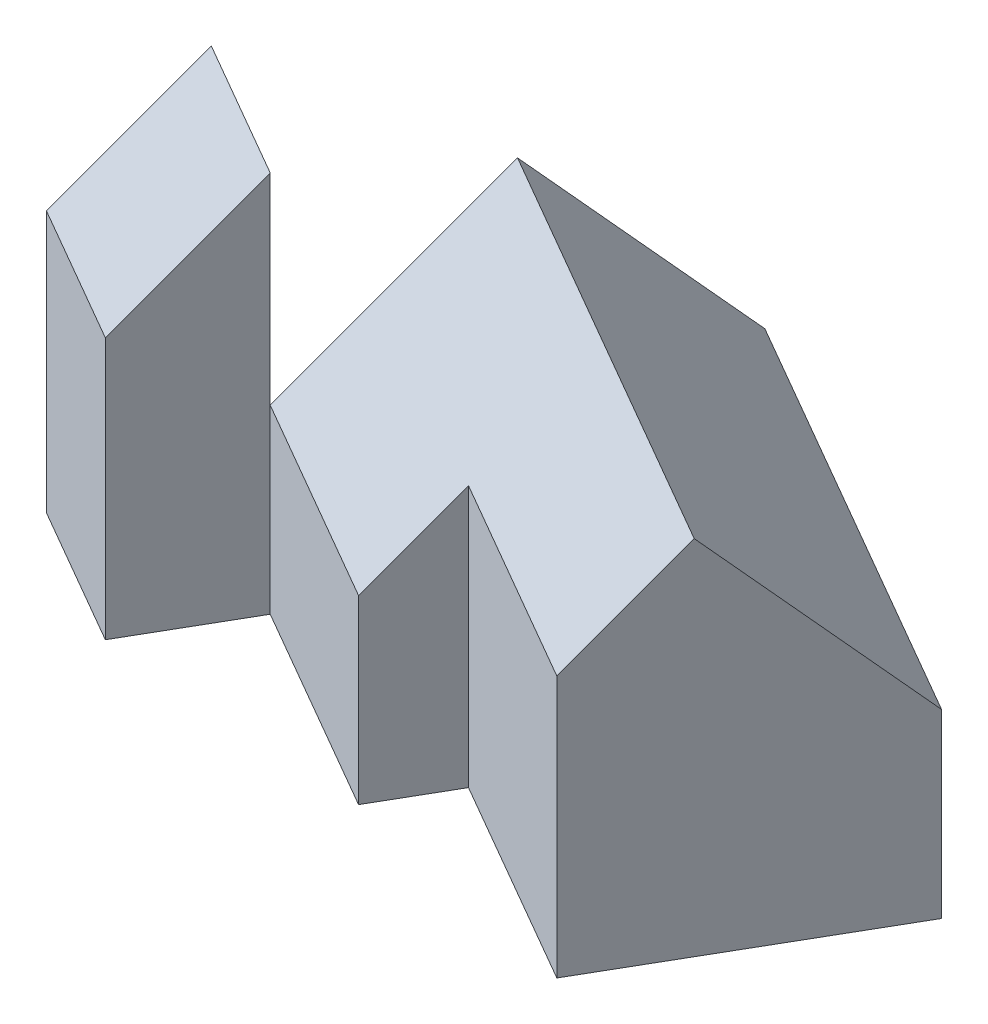
ISO-10303-21;
HEADER;
FILE_DESCRIPTION(('STEP AP214'),'2;1');
FILE_NAME('part.step','',(''),(''),'','','');
FILE_SCHEMA(('AUTOMOTIVE_DESIGN { 1 0 10303 214 1 1 1 1 }'));
ENDSEC;
DATA;
#1=APPLICATION_CONTEXT('core data for automotive mechanical design processes');
#2=APPLICATION_PROTOCOL_DEFINITION('international standard','automotive_design',2000,#1);
#3=PRODUCT_CONTEXT('',#1,'mechanical');
#4=PRODUCT('Part','Part','',(#3));
#5=PRODUCT_RELATED_PRODUCT_CATEGORY('part','',(#4));
#6=PRODUCT_DEFINITION_FORMATION('','',#4);
#7=PRODUCT_DEFINITION_CONTEXT('part definition',#1,'design');
#8=PRODUCT_DEFINITION('design','',#6,#7);
#9=PRODUCT_DEFINITION_SHAPE('','',#8);
#10=(LENGTH_UNIT() NAMED_UNIT(*) SI_UNIT(.MILLI.,.METRE.));
#11=(NAMED_UNIT(*) PLANE_ANGLE_UNIT() SI_UNIT($,.RADIAN.));
#12=(NAMED_UNIT(*) SI_UNIT($,.STERADIAN.) SOLID_ANGLE_UNIT());
#13=UNCERTAINTY_MEASURE_WITH_UNIT(LENGTH_MEASURE(1.E-05),#10,'distance_accuracy_value','');
#14=(GEOMETRIC_REPRESENTATION_CONTEXT(3) GLOBAL_UNCERTAINTY_ASSIGNED_CONTEXT((#13)) GLOBAL_UNIT_ASSIGNED_CONTEXT((#10,
#11,#12)) REPRESENTATION_CONTEXT('',''));
#15=CARTESIAN_POINT('',(0.,0.,0.));
#16=DIRECTION('',(0.,0.,1.));
#17=DIRECTION('',(1.,0.,0.));
#18=AXIS2_PLACEMENT_3D('',#15,#16,#17);
#19=CARTESIAN_POINT('',(-84.1610832087339,95.,25.7712721375595));
#20=DIRECTION('',(-0.86602540378444,0.,-0.499999999999997));
#21=DIRECTION('',(-0.499999999999997,0.,0.86602540378444));
#22=AXIS2_PLACEMENT_3D('',#19,#20,#21);
#23=PLANE('',#22);
#24=DIRECTION('',(0.,-1.,0.));
#25=VECTOR('',#24,1.);
#26=CARTESIAN_POINT('',(-51.9615242270664,95.,-29.9999999999998));
#27=LINE('',#26,#25);
#28=CARTESIAN_POINT('',(-51.9615242270664,64.9999999999999,-29.9999999999998));
#29=VERTEX_POINT('',#28);
#30=CARTESIAN_POINT('',(-51.9615242270664,0.,-29.9999999999998));
#31=VERTEX_POINT('',#30);
#32=EDGE_CURVE('E79',#29,#31,#27,.T.);
#33=ORIENTED_EDGE('',*,*,#32,.F.);
#34=DIRECTION('',(-0.353553390593272,-0.707106781186547,0.612372435695796));
#35=VECTOR('',#34,1.);
#36=CARTESIAN_POINT('',(-60.5613037179002,47.8004410183323,-15.1047449879867));
#37=LINE('',#36,#35);
#38=CARTESIAN_POINT('',(-61.9615242270663,45.,-12.679491924311));
#39=VERTEX_POINT('',#38);
#40=EDGE_CURVE('E158',#29,#39,#37,.T.);
#41=ORIENTED_EDGE('',*,*,#40,.T.);
#42=DIRECTION('',(0.,-1.,0.));
#43=VECTOR('',#42,1.);
#44=CARTESIAN_POINT('',(-61.9615242270664,95.,-12.679491924311));
#45=LINE('',#44,#43);
#46=CARTESIAN_POINT('',(-61.9615242270664,0.,-12.679491924311));
#47=VERTEX_POINT('',#46);
#48=EDGE_CURVE('E94',#39,#47,#45,.T.);
#49=ORIENTED_EDGE('',*,*,#48,.T.);
#50=DIRECTION('',(0.499999999999997,0.,-0.86602540378444));
#51=VECTOR('',#50,1.);
#52=CARTESIAN_POINT('',(-84.1610832087339,0.,25.7712721375595));
#53=LINE('',#52,#51);
#54=EDGE_CURVE('E160',#47,#31,#53,.T.);
#55=ORIENTED_EDGE('',*,*,#54,.T.);
#56=EDGE_LOOP('',(#33,#41,#49,#55));
#57=FACE_BOUND('',#56,.T.);
#58=ADVANCED_FACE('F72',(#57),#23,.F.);
#59=CARTESIAN_POINT('',(-212.033597537442,95.,-122.417654615486));
#60=DIRECTION('',(0.499999999999997,0.,-0.86602540378444));
#61=DIRECTION('',(-0.86602540378444,0.,-0.499999999999997));
#62=AXIS2_PLACEMENT_3D('',#59,#60,#61);
#63=PLANE('',#62);
#64=DIRECTION('',(0.,-1.,0.));
#65=VECTOR('',#64,1.);
#66=CARTESIAN_POINT('',(0.,95.,0.));
#67=LINE('',#66,#65);
#68=CARTESIAN_POINT('',(0.,65.,0.));
#69=VERTEX_POINT('',#68);
#70=CARTESIAN_POINT('',(0.,0.,0.));
#71=VERTEX_POINT('',#70);
#72=EDGE_CURVE('E181',#69,#71,#67,.T.);
#73=ORIENTED_EDGE('',*,*,#72,.F.);
#74=DIRECTION('',(-0.86602540378444,0.,-0.499999999999997));
#75=VECTOR('',#74,1.);
#76=CARTESIAN_POINT('',(-212.033597537442,64.9999999999998,-122.417654615486));
#77=LINE('',#76,#75);
#78=EDGE_CURVE('E144',#69,#29,#77,.T.);
#79=ORIENTED_EDGE('',*,*,#78,.T.);
#80=ORIENTED_EDGE('',*,*,#32,.T.);
#81=DIRECTION('',(0.86602540378444,0.,0.499999999999997));
#82=VECTOR('',#81,1.);
#83=CARTESIAN_POINT('',(-212.033597537442,0.,-122.417654615486));
#84=LINE('',#83,#82);
#85=EDGE_CURVE('E162',#31,#71,#84,.T.);
#86=ORIENTED_EDGE('',*,*,#85,.T.);
#87=EDGE_LOOP('',(#73,#79,#80,#86));
#88=FACE_BOUND('',#87,.T.);
#89=ADVANCED_FACE('F185',(#88),#63,.F.);
#90=CARTESIAN_POINT('',(-32.1995589816676,95.,55.7712721375595));
#91=DIRECTION('',(-0.86602540378444,0.,-0.499999999999998));
#92=DIRECTION('',(-0.499999999999998,0.,0.86602540378444));
#93=AXIS2_PLACEMENT_3D('',#90,#91,#92);
#94=PLANE('',#93);
#95=DIRECTION('',(0.,-1.,0.));
#96=VECTOR('',#95,1.);
#97=CARTESIAN_POINT('',(34.9999999999999,95.,-60.6217782649108));
#98=LINE('',#97,#96);
#99=CARTESIAN_POINT('',(34.9999999999999,45.,-60.6217782649108));
#100=VERTEX_POINT('',#99);
#101=CARTESIAN_POINT('',(34.9999999999999,0.,-60.6217782649108));
#102=VERTEX_POINT('',#101);
#103=EDGE_CURVE('E151',#100,#102,#98,.T.);
#104=ORIENTED_EDGE('',*,*,#103,.F.);
#105=DIRECTION('',(0.353553390593272,-0.707106781186548,-0.612372435695796));
#106=VECTOR('',#105,1.);
#107=CARTESIAN_POINT('',(12.5,90.,-21.650635094611));
#108=LINE('',#107,#106);
#109=CARTESIAN_POINT('',(12.5,90.,-21.650635094611));
#110=VERTEX_POINT('',#109);
#111=EDGE_CURVE('E135',#110,#100,#108,.T.);
#112=ORIENTED_EDGE('',*,*,#111,.F.);
#113=DIRECTION('',(0.353553390593272,0.707106781186547,-0.612372435695796));
#114=VECTOR('',#113,1.);
#115=CARTESIAN_POINT('',(-9.99999999999997,45.,17.3205080756888));
#116=LINE('',#115,#114);
#117=EDGE_CURVE('E141',#69,#110,#116,.T.);
#118=ORIENTED_EDGE('',*,*,#117,.F.);
#119=ORIENTED_EDGE('',*,*,#72,.T.);
#120=DIRECTION('',(0.499999999999998,0.,-0.86602540378444));
#121=VECTOR('',#120,1.);
#122=CARTESIAN_POINT('',(-32.1995589816676,0.,55.7712721375595));
#123=LINE('',#122,#121);
#124=EDGE_CURVE('E165',#71,#102,#123,.T.);
#125=ORIENTED_EDGE('',*,*,#124,.T.);
#126=EDGE_LOOP('',(#104,#112,#118,#119,#125));
#127=FACE_BOUND('',#126,.T.);
#128=ADVANCED_FACE('F149',(#127),#94,.F.);
#129=CARTESIAN_POINT('',(-177.033597537442,95.,-183.039432880397));
#130=DIRECTION('',(-0.5,0.,0.866025403784439));
#131=DIRECTION('',(0.866025403784439,0.,0.5));
#132=AXIS2_PLACEMENT_3D('',#129,#130,#131);
#133=PLANE('',#132);
#134=DIRECTION('',(0.,-1.,0.));
#135=VECTOR('',#134,1.);
#136=CARTESIAN_POINT('',(-68.9230484541331,95.,-120.621778264911));
#137=LINE('',#136,#135);
#138=CARTESIAN_POINT('',(-68.9230484541332,45.,-120.621778264911));
#139=VERTEX_POINT('',#138);
#140=CARTESIAN_POINT('',(-68.9230484541331,0.,-120.621778264911));
#141=VERTEX_POINT('',#140);
#142=EDGE_CURVE('E178',#139,#141,#137,.T.);
#143=ORIENTED_EDGE('',*,*,#142,.F.);
#144=DIRECTION('',(0.86602540378444,0.,0.499999999999998));
#145=VECTOR('',#144,1.);
#146=CARTESIAN_POINT('',(-73.2531754730551,45.,-123.121778264911));
#147=LINE('',#146,#145);
#148=EDGE_CURVE('E137',#139,#100,#147,.T.);
#149=ORIENTED_EDGE('',*,*,#148,.T.);
#150=ORIENTED_EDGE('',*,*,#103,.T.);
#151=DIRECTION('',(-0.866025403784439,0.,-0.5));
#152=VECTOR('',#151,1.);
#153=CARTESIAN_POINT('',(-177.033597537442,0.,-183.039432880397));
#154=LINE('',#153,#152);
#155=EDGE_CURVE('E167',#102,#141,#154,.T.);
#156=ORIENTED_EDGE('',*,*,#155,.T.);
#157=EDGE_LOOP('',(#143,#149,#150,#156));
#158=FACE_BOUND('',#157,.T.);
#159=ADVANCED_FACE('F199',(#158),#133,.F.);
#160=CARTESIAN_POINT('',(-136.1226074358,95.,-4.22872786244057));
#161=DIRECTION('',(0.866025403784442,0.,0.499999999999994));
#162=DIRECTION('',(0.499999999999994,0.,-0.866025403784442));
#163=AXIS2_PLACEMENT_3D('',#160,#161,#162);
#164=PLANE('',#163);
#165=DIRECTION('',(0.35355339059327,0.707106781186547,-0.612372435695797));
#166=VECTOR('',#165,1.);
#167=CARTESIAN_POINT('',(-112.522827944967,47.8004410183324,-45.1047449879868));
#168=LINE('',#167,#166);
#169=CARTESIAN_POINT('',(-113.923048454133,45.,-42.6794919243109));
#170=VERTEX_POINT('',#169);
#171=CARTESIAN_POINT('',(-91.423048454133,90.,-81.6506350946108));
#172=VERTEX_POINT('',#171);
#173=EDGE_CURVE('E86',#170,#172,#168,.T.);
#174=ORIENTED_EDGE('',*,*,#173,.T.);
#175=DIRECTION('',(0.35355339059327,-0.707106781186548,-0.612372435695797));
#176=VECTOR('',#175,1.);
#177=CARTESIAN_POINT('',(-115.022827944967,137.199558981668,-40.7746179690646));
#178=LINE('',#177,#176);
#179=EDGE_CURVE('E13',#172,#139,#178,.T.);
#180=ORIENTED_EDGE('',*,*,#179,.T.);
#181=ORIENTED_EDGE('',*,*,#142,.T.);
#182=DIRECTION('',(-0.499999999999994,0.,0.866025403784442));
#183=VECTOR('',#182,1.);
#184=CARTESIAN_POINT('',(-136.1226074358,0.,-4.22872786244057));
#185=LINE('',#184,#183);
#186=CARTESIAN_POINT('',(-113.923048454133,0.,-42.6794919243109));
#187=VERTEX_POINT('',#186);
#188=EDGE_CURVE('E170',#141,#187,#185,.T.);
#189=ORIENTED_EDGE('',*,*,#188,.T.);
#190=DIRECTION('',(0.,-1.,0.));
#191=VECTOR('',#190,1.);
#192=CARTESIAN_POINT('',(-113.923048454133,95.,-42.6794919243109));
#193=LINE('',#192,#191);
#194=EDGE_CURVE('E176',#170,#187,#193,.T.);
#195=ORIENTED_EDGE('',*,*,#194,.F.);
#196=EDGE_LOOP('',(#174,#180,#181,#189,#195));
#197=FACE_BOUND('',#196,.T.);
#198=ADVANCED_FACE('F204',(#197),#164,.F.);
#199=CARTESIAN_POINT('',(-222.033597537442,95.,-105.097146539797));
#200=DIRECTION('',(0.499999999999997,0.,-0.86602540378444));
#201=DIRECTION('',(-0.86602540378444,0.,-0.499999999999997));
#202=AXIS2_PLACEMENT_3D('',#199,#200,#201);
#203=PLANE('',#202);
#204=ORIENTED_EDGE('',*,*,#48,.F.);
#205=DIRECTION('',(0.86602540378444,0.,0.499999999999998));
#206=VECTOR('',#205,1.);
#207=CARTESIAN_POINT('',(-118.253175473055,45.,-45.1794919243109));
#208=LINE('',#207,#206);
#209=EDGE_CURVE('E138',#170,#39,#208,.T.);
#210=ORIENTED_EDGE('',*,*,#209,.F.);
#211=ORIENTED_EDGE('',*,*,#194,.T.);
#212=DIRECTION('',(0.86602540378444,0.,0.499999999999997));
#213=VECTOR('',#212,1.);
#214=CARTESIAN_POINT('',(-222.033597537442,0.,-105.097146539797));
#215=LINE('',#214,#213);
#216=EDGE_CURVE('E173',#187,#47,#215,.T.);
#217=ORIENTED_EDGE('',*,*,#216,.T.);
#218=EDGE_LOOP('',(#204,#210,#211,#217));
#219=FACE_BOUND('',#218,.T.);
#220=ADVANCED_FACE('F208',(#219),#203,.F.);
#221=CARTESIAN_POINT('',(-244.23315651911,0.,-66.6463824779267));
#222=DIRECTION('',(0.,1.,0.));
#223=DIRECTION('',(0.,0.,1.));
#224=AXIS2_PLACEMENT_3D('',#221,#222,#223);
#225=PLANE('',#224);
#226=ORIENTED_EDGE('',*,*,#54,.F.);
#227=ORIENTED_EDGE('',*,*,#216,.F.);
#228=ORIENTED_EDGE('',*,*,#188,.F.);
#229=ORIENTED_EDGE('',*,*,#155,.F.);
#230=ORIENTED_EDGE('',*,*,#124,.F.);
#231=ORIENTED_EDGE('',*,*,#85,.F.);
#232=EDGE_LOOP('',(#226,#227,#228,#229,#230,#231));
#233=FACE_BOUND('',#232,.T.);
#234=ADVANCED_FACE('F189',(#233),#225,.F.);
#235=CARTESIAN_POINT('',(-95.753175473055,90.,-84.1506350946107));
#236=DIRECTION('',(-0.353553390593272,-0.707106781186548,0.612372435695795));
#237=DIRECTION('',(0.,-0.654653670707978,-0.755928946018454));
#238=AXIS2_PLACEMENT_3D('',#235,#236,#237);
#239=PLANE('',#238);
#240=DIRECTION('',(0.86602540378444,0.,0.499999999999998));
#241=VECTOR('',#240,1.);
#242=CARTESIAN_POINT('',(-95.753175473055,90.,-84.1506350946107));
#243=LINE('',#242,#241);
#244=EDGE_CURVE('E131',#172,#110,#243,.T.);
#245=ORIENTED_EDGE('',*,*,#244,.T.);
#246=ORIENTED_EDGE('',*,*,#111,.T.);
#247=ORIENTED_EDGE('',*,*,#148,.F.);
#248=ORIENTED_EDGE('',*,*,#179,.F.);
#249=EDGE_LOOP('',(#245,#246,#247,#248));
#250=FACE_BOUND('',#249,.T.);
#251=ADVANCED_FACE('F133',(#250),#239,.F.);
#252=CARTESIAN_POINT('',(-118.253175473055,45.,-45.1794919243109));
#253=DIRECTION('',(0.353553390593272,-0.707106781186548,-0.612372435695795));
#254=DIRECTION('',(0.,0.654653670707977,-0.755928946018454));
#255=AXIS2_PLACEMENT_3D('',#252,#253,#254);
#256=PLANE('',#255);
#257=ORIENTED_EDGE('',*,*,#78,.F.);
#258=ORIENTED_EDGE('',*,*,#117,.T.);
#259=ORIENTED_EDGE('',*,*,#244,.F.);
#260=ORIENTED_EDGE('',*,*,#173,.F.);
#261=ORIENTED_EDGE('',*,*,#209,.T.);
#262=ORIENTED_EDGE('',*,*,#40,.F.);
#263=EDGE_LOOP('',(#257,#258,#259,#260,#261,#262));
#264=FACE_BOUND('',#263,.T.);
#265=ADVANCED_FACE('F142',(#264),#256,.F.);
#266=CLOSED_SHELL('',(#58,#89,#128,#159,#198,#220,#234,#251,#265));
#267=MANIFOLD_SOLID_BREP('B2',#266);
#268=CARTESIAN_POINT('',(-222.033597537442,95.,-105.097146539797));
#269=DIRECTION('',(0.499999999999998,0.,-0.86602540378444));
#270=DIRECTION('',(-0.86602540378444,0.,-0.499999999999998));
#271=AXIS2_PLACEMENT_3D('',#268,#269,#270);
#272=PLANE('',#271);
#273=DIRECTION('',(0.,-1.,0.));
#274=VECTOR('',#273,1.);
#275=CARTESIAN_POINT('',(-113.923048454133,95.,-42.6794919243109));
#276=LINE('',#275,#274);
#277=CARTESIAN_POINT('',(-113.923048454133,95.,-42.6794919243109));
#278=VERTEX_POINT('',#277);
#279=CARTESIAN_POINT('',(-113.923048454133,0.,-42.6794919243109));
#280=VERTEX_POINT('',#279);
#281=EDGE_CURVE('E313',#278,#280,#276,.T.);
#282=ORIENTED_EDGE('',*,*,#281,.T.);
#283=DIRECTION('',(0.86602540378444,0.,0.499999999999998));
#284=VECTOR('',#283,1.);
#285=CARTESIAN_POINT('',(-222.033597537442,0.,-105.097146539797));
#286=LINE('',#285,#284);
#287=CARTESIAN_POINT('',(-148.56406460551,0.,-62.6794919243108));
#288=VERTEX_POINT('',#287);
#289=EDGE_CURVE('E327',#288,#280,#286,.T.);
#290=ORIENTED_EDGE('',*,*,#289,.F.);
#291=DIRECTION('',(0.,-1.,0.));
#292=VECTOR('',#291,1.);
#293=CARTESIAN_POINT('',(-148.56406460551,95.,-62.6794919243108));
#294=LINE('',#293,#292);
#295=CARTESIAN_POINT('',(-148.56406460551,95.,-62.6794919243107));
#296=VERTEX_POINT('',#295);
#297=EDGE_CURVE('E70',#296,#288,#294,.T.);
#298=ORIENTED_EDGE('',*,*,#297,.F.);
#299=DIRECTION('',(0.86602540378444,0.,0.499999999999998));
#300=VECTOR('',#299,1.);
#301=CARTESIAN_POINT('',(-222.033597537442,95.,-105.097146539797));
#302=LINE('',#301,#300);
#303=EDGE_CURVE('E328',#296,#278,#302,.T.);
#304=ORIENTED_EDGE('',*,*,#303,.T.);
#305=EDGE_LOOP('',(#282,#290,#298,#304));
#306=FACE_BOUND('',#305,.T.);
#307=ADVANCED_FACE('F273',(#306),#272,.T.);
#308=CARTESIAN_POINT('',(-170.763623587178,95.,-24.2287278624402));
#309=DIRECTION('',(-0.866025403784441,0.,-0.499999999999997));
#310=DIRECTION('',(-0.499999999999997,0.,0.866025403784441));
#311=AXIS2_PLACEMENT_3D('',#308,#309,#310);
#312=PLANE('',#311);
#313=DIRECTION('',(-0.353553390593272,-0.707106781186546,0.612372435695797));
#314=VECTOR('',#313,1.);
#315=CARTESIAN_POINT('',(-159.663844096344,72.8004410183323,-43.4541098933754));
#316=LINE('',#315,#314);
#317=CARTESIAN_POINT('',(-163.56406460551,65.,-36.6987298107774));
#318=VERTEX_POINT('',#317);
#319=EDGE_CURVE('E339',#296,#318,#316,.T.);
#320=ORIENTED_EDGE('',*,*,#319,.F.);
#321=ORIENTED_EDGE('',*,*,#297,.T.);
#322=DIRECTION('',(0.499999999999997,0.,-0.866025403784441));
#323=VECTOR('',#322,1.);
#324=CARTESIAN_POINT('',(-170.763623587178,0.,-24.2287278624402));
#325=LINE('',#324,#323);
#326=CARTESIAN_POINT('',(-163.56406460551,0.,-36.6987298107776));
#327=VERTEX_POINT('',#326);
#328=EDGE_CURVE('E322',#327,#288,#325,.T.);
#329=ORIENTED_EDGE('',*,*,#328,.F.);
#330=DIRECTION('',(0.,-1.,0.));
#331=VECTOR('',#330,1.);
#332=CARTESIAN_POINT('',(-163.56406460551,95.,-36.6987298107776));
#333=LINE('',#332,#331);
#334=EDGE_CURVE('E281',#318,#327,#333,.T.);
#335=ORIENTED_EDGE('',*,*,#334,.F.);
#336=EDGE_LOOP('',(#320,#321,#329,#335));
#337=FACE_BOUND('',#336,.T.);
#338=ADVANCED_FACE('F341',(#337),#312,.T.);
#339=CARTESIAN_POINT('',(-237.033597537442,95.,-79.1163844262643));
#340=DIRECTION('',(-0.500000000000001,0.,0.866025403784438));
#341=DIRECTION('',(0.866025403784438,0.,0.500000000000001));
#342=AXIS2_PLACEMENT_3D('',#339,#340,#341);
#343=PLANE('',#342);
#344=DIRECTION('',(0.86602540378444,0.,0.499999999999997));
#345=VECTOR('',#344,1.);
#346=CARTESIAN_POINT('',(-237.176223927188,65.,-79.1987298107772));
#347=LINE('',#346,#345);
#348=CARTESIAN_POINT('',(-128.923048454133,65.,-16.6987298107776));
#349=VERTEX_POINT('',#348);
#350=EDGE_CURVE('E342',#318,#349,#347,.T.);
#351=ORIENTED_EDGE('',*,*,#350,.F.);
#352=ORIENTED_EDGE('',*,*,#334,.T.);
#353=DIRECTION('',(-0.866025403784438,0.,-0.500000000000001));
#354=VECTOR('',#353,1.);
#355=CARTESIAN_POINT('',(-237.033597537442,0.,-79.1163844262643));
#356=LINE('',#355,#354);
#357=CARTESIAN_POINT('',(-128.923048454133,0.,-16.6987298107775));
#358=VERTEX_POINT('',#357);
#359=EDGE_CURVE('E316',#358,#327,#356,.T.);
#360=ORIENTED_EDGE('',*,*,#359,.F.);
#361=DIRECTION('',(0.,-1.,0.));
#362=VECTOR('',#361,1.);
#363=CARTESIAN_POINT('',(-128.923048454133,95.,-16.6987298107775));
#364=LINE('',#363,#362);
#365=EDGE_CURVE('E304',#349,#358,#364,.T.);
#366=ORIENTED_EDGE('',*,*,#365,.F.);
#367=EDGE_LOOP('',(#351,#352,#360,#366));
#368=FACE_BOUND('',#367,.T.);
#369=ADVANCED_FACE('F317',(#368),#343,.T.);
#370=CARTESIAN_POINT('',(-136.1226074358,95.,-4.22872786244029));
#371=DIRECTION('',(0.86602540378444,0.,0.499999999999997));
#372=DIRECTION('',(0.499999999999997,0.,-0.86602540378444));
#373=AXIS2_PLACEMENT_3D('',#370,#371,#372);
#374=PLANE('',#373);
#375=DIRECTION('',(0.353553390593273,0.707106781186546,-0.612372435695797));
#376=VECTOR('',#375,1.);
#377=CARTESIAN_POINT('',(-128.923048454133,65.,-16.6987298107776));
#378=LINE('',#377,#376);
#379=EDGE_CURVE('E288',#349,#278,#378,.T.);
#380=ORIENTED_EDGE('',*,*,#379,.F.);
#381=ORIENTED_EDGE('',*,*,#365,.T.);
#382=DIRECTION('',(-0.499999999999997,0.,0.86602540378444));
#383=VECTOR('',#382,1.);
#384=CARTESIAN_POINT('',(-136.1226074358,0.,-4.22872786244029));
#385=LINE('',#384,#383);
#386=EDGE_CURVE('E309',#280,#358,#385,.T.);
#387=ORIENTED_EDGE('',*,*,#386,.F.);
#388=ORIENTED_EDGE('',*,*,#281,.F.);
#389=EDGE_LOOP('',(#380,#381,#387,#388));
#390=FACE_BOUND('',#389,.T.);
#391=ADVANCED_FACE('F306',(#390),#374,.T.);
#392=CARTESIAN_POINT('',(-244.23315651911,0.,-66.6463824779267));
#393=DIRECTION('',(0.,1.,0.));
#394=DIRECTION('',(0.,0.,1.));
#395=AXIS2_PLACEMENT_3D('',#392,#393,#394);
#396=PLANE('',#395);
#397=ORIENTED_EDGE('',*,*,#289,.T.);
#398=ORIENTED_EDGE('',*,*,#386,.T.);
#399=ORIENTED_EDGE('',*,*,#359,.T.);
#400=ORIENTED_EDGE('',*,*,#328,.T.);
#401=EDGE_LOOP('',(#397,#398,#399,#400));
#402=FACE_BOUND('',#401,.T.);
#403=ADVANCED_FACE('F325',(#402),#396,.F.);
#404=CARTESIAN_POINT('',(-237.176223927188,65.,-79.1987298107772));
#405=DIRECTION('',(0.353553390593271,-0.707106781186549,-0.612372435695794));
#406=DIRECTION('',(0.,0.654653670707976,-0.755928946018456));
#407=AXIS2_PLACEMENT_3D('',#404,#405,#406);
#408=PLANE('',#407);
#409=ORIENTED_EDGE('',*,*,#319,.T.);
#410=ORIENTED_EDGE('',*,*,#350,.T.);
#411=ORIENTED_EDGE('',*,*,#379,.T.);
#412=ORIENTED_EDGE('',*,*,#303,.F.);
#413=EDGE_LOOP('',(#409,#410,#411,#412));
#414=FACE_BOUND('',#413,.T.);
#415=ADVANCED_FACE('F337',(#414),#408,.F.);
#416=CLOSED_SHELL('',(#307,#338,#369,#391,#403,#415));
#417=MANIFOLD_SOLID_BREP('B7',#416);
#418=ADVANCED_BREP_SHAPE_REPRESENTATION('',(#18,#267,#417),#14);
#419=SHAPE_DEFINITION_REPRESENTATION(#9,#418);
ENDSEC;
END-ISO-10303-21;
